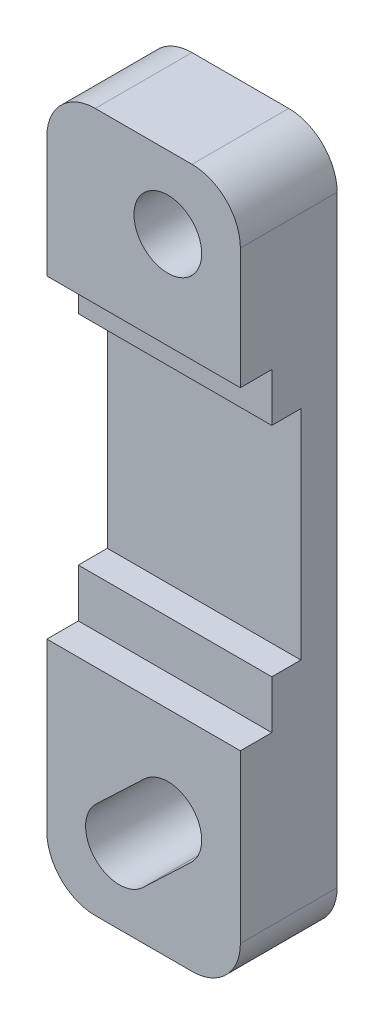
ISO-10303-21;
HEADER;
FILE_DESCRIPTION(('STEP AP214'),'2;1');
FILE_NAME('part.step','',(''),(''),'','','');
FILE_SCHEMA(('AUTOMOTIVE_DESIGN { 1 0 10303 214 1 1 1 1 }'));
ENDSEC;
DATA;
#1=APPLICATION_CONTEXT('core data for automotive mechanical design processes');
#2=APPLICATION_PROTOCOL_DEFINITION('international standard','automotive_design',2000,#1);
#3=PRODUCT_CONTEXT('',#1,'mechanical');
#4=PRODUCT('Part','Part','',(#3));
#5=PRODUCT_RELATED_PRODUCT_CATEGORY('part','',(#4));
#6=PRODUCT_DEFINITION_FORMATION('','',#4);
#7=PRODUCT_DEFINITION_CONTEXT('part definition',#1,'design');
#8=PRODUCT_DEFINITION('design','',#6,#7);
#9=PRODUCT_DEFINITION_SHAPE('','',#8);
#10=(LENGTH_UNIT() NAMED_UNIT(*) SI_UNIT(.MILLI.,.METRE.));
#11=(NAMED_UNIT(*) PLANE_ANGLE_UNIT() SI_UNIT($,.RADIAN.));
#12=(NAMED_UNIT(*) SI_UNIT($,.STERADIAN.) SOLID_ANGLE_UNIT());
#13=UNCERTAINTY_MEASURE_WITH_UNIT(LENGTH_MEASURE(1.E-05),#10,'distance_accuracy_value','');
#14=(GEOMETRIC_REPRESENTATION_CONTEXT(3) GLOBAL_UNCERTAINTY_ASSIGNED_CONTEXT((#13)) GLOBAL_UNIT_ASSIGNED_CONTEXT((#10,
#11,#12)) REPRESENTATION_CONTEXT('',''));
#15=CARTESIAN_POINT('',(0.,0.,0.));
#16=DIRECTION('',(0.,0.,1.));
#17=DIRECTION('',(1.,0.,0.));
#18=AXIS2_PLACEMENT_3D('',#15,#16,#17);
#19=CARTESIAN_POINT('',(1.,11.5,4.));
#20=DIRECTION('',(0.,0.,-1.));
#21=DIRECTION('',(-1.,0.,0.));
#22=AXIS2_PLACEMENT_3D('',#19,#20,#21);
#23=PLANE('',#22);
#24=CARTESIAN_POINT('',(0.,10.5,4.));
#25=DIRECTION('',(0.,0.,1.));
#26=DIRECTION('',(1.,0.,0.));
#27=AXIS2_PLACEMENT_3D('',#24,#25,#26);
#28=CIRCLE('',#27,1.4);
#29=CARTESIAN_POINT('',(1.4,10.5,4.));
#30=VERTEX_POINT('',#29);
#31=EDGE_CURVE('E215',#30,#30,#28,.T.);
#32=ORIENTED_EDGE('',*,*,#31,.F.);
#33=EDGE_LOOP('',(#32));
#34=FACE_BOUND('',#33,.T.);
#35=DIRECTION('',(0.,-1.,0.));
#36=VECTOR('',#35,1.);
#37=CARTESIAN_POINT('',(-5.,11.5,4.));
#38=LINE('',#37,#36);
#39=CARTESIAN_POINT('',(-5.,11.5,4.));
#40=VERTEX_POINT('',#39);
#41=CARTESIAN_POINT('',(-5.,6.5,4.));
#42=VERTEX_POINT('',#41);
#43=EDGE_CURVE('E194',#40,#42,#38,.T.);
#44=ORIENTED_EDGE('',*,*,#43,.T.);
#45=DIRECTION('',(1.,0.,0.));
#46=VECTOR('',#45,1.);
#47=CARTESIAN_POINT('',(-5.,6.5,4.));
#48=LINE('',#47,#46);
#49=CARTESIAN_POINT('',(3.,6.5,4.));
#50=VERTEX_POINT('',#49);
#51=EDGE_CURVE('E299',#42,#50,#48,.T.);
#52=ORIENTED_EDGE('',*,*,#51,.T.);
#53=DIRECTION('',(0.,1.,0.));
#54=VECTOR('',#53,1.);
#55=CARTESIAN_POINT('',(3.,11.5,4.));
#56=LINE('',#55,#54);
#57=CARTESIAN_POINT('',(3.,11.5,4.));
#58=VERTEX_POINT('',#57);
#59=EDGE_CURVE('E208',#50,#58,#56,.T.);
#60=ORIENTED_EDGE('',*,*,#59,.T.);
#61=CARTESIAN_POINT('',(1.,11.5,4.));
#62=DIRECTION('',(0.,0.,1.));
#63=DIRECTION('',(-1.,0.,0.));
#64=AXIS2_PLACEMENT_3D('',#61,#62,#63);
#65=CIRCLE('',#64,2.);
#66=CARTESIAN_POINT('',(0.999999999999987,13.5,4.));
#67=VERTEX_POINT('',#66);
#68=EDGE_CURVE('E229',#58,#67,#65,.T.);
#69=ORIENTED_EDGE('',*,*,#68,.T.);
#70=DIRECTION('',(-1.,0.,0.));
#71=VECTOR('',#70,1.);
#72=CARTESIAN_POINT('',(0.999999999999987,13.5,4.));
#73=LINE('',#72,#71);
#74=CARTESIAN_POINT('',(-2.99999999999999,13.5,4.));
#75=VERTEX_POINT('',#74);
#76=EDGE_CURVE('E199',#67,#75,#73,.T.);
#77=ORIENTED_EDGE('',*,*,#76,.T.);
#78=CARTESIAN_POINT('',(-3.,11.5,4.));
#79=DIRECTION('',(0.,0.,1.));
#80=DIRECTION('',(1.,0.,0.));
#81=AXIS2_PLACEMENT_3D('',#78,#79,#80);
#82=CIRCLE('',#81,2.);
#83=EDGE_CURVE('E195',#75,#40,#82,.T.);
#84=ORIENTED_EDGE('',*,*,#83,.T.);
#85=EDGE_LOOP('',(#44,#52,#60,#69,#77,#84));
#86=FACE_BOUND('',#85,.T.);
#87=ADVANCED_FACE('F33',(#34,#86),#23,.F.);
#88=CARTESIAN_POINT('',(3.,-13.4,4.));
#89=VERTEX_POINT('',#88);
#90=CARTESIAN_POINT('',(3.,-6.5,4.));
#91=VERTEX_POINT('',#90);
#92=EDGE_CURVE('E186',#89,#91,#56,.T.);
#93=ORIENTED_EDGE('',*,*,#92,.T.);
#94=DIRECTION('',(1.,0.,0.));
#95=VECTOR('',#94,1.);
#96=CARTESIAN_POINT('',(-5.,-6.5,4.));
#97=LINE('',#96,#95);
#98=CARTESIAN_POINT('',(-5.,-6.5,4.));
#99=VERTEX_POINT('',#98);
#100=EDGE_CURVE('E48',#99,#91,#97,.T.);
#101=ORIENTED_EDGE('',*,*,#100,.F.);
#102=CARTESIAN_POINT('',(-5.,-13.4,4.));
#103=VERTEX_POINT('',#102);
#104=EDGE_CURVE('E183',#99,#103,#38,.T.);
#105=ORIENTED_EDGE('',*,*,#104,.T.);
#106=CARTESIAN_POINT('',(-3.,-13.4,4.));
#107=DIRECTION('',(0.,0.,1.));
#108=DIRECTION('',(-1.,0.,0.));
#109=AXIS2_PLACEMENT_3D('',#106,#107,#108);
#110=CIRCLE('',#109,2.);
#111=CARTESIAN_POINT('',(-2.99999999999999,-15.4,4.));
#112=VERTEX_POINT('',#111);
#113=EDGE_CURVE('E198',#103,#112,#110,.T.);
#114=ORIENTED_EDGE('',*,*,#113,.T.);
#115=DIRECTION('',(1.,0.,0.));
#116=VECTOR('',#115,1.);
#117=CARTESIAN_POINT('',(0.999999999999984,-15.4,4.));
#118=LINE('',#117,#116);
#119=CARTESIAN_POINT('',(0.999999999999984,-15.4,4.));
#120=VERTEX_POINT('',#119);
#121=EDGE_CURVE('E204',#112,#120,#118,.T.);
#122=ORIENTED_EDGE('',*,*,#121,.T.);
#123=CARTESIAN_POINT('',(0.999999999999998,-13.4,4.));
#124=DIRECTION('',(0.,0.,1.));
#125=DIRECTION('',(-1.,0.,0.));
#126=AXIS2_PLACEMENT_3D('',#123,#124,#125);
#127=CIRCLE('',#126,2.);
#128=EDGE_CURVE('E206',#120,#89,#127,.T.);
#129=ORIENTED_EDGE('',*,*,#128,.T.);
#130=EDGE_LOOP('',(#93,#101,#105,#114,#122,#129));
#131=FACE_BOUND('',#130,.T.);
#132=CARTESIAN_POINT('',(0.,-10.5,4.));
#133=DIRECTION('',(0.,0.,1.));
#134=DIRECTION('',(-1.,0.,0.));
#135=AXIS2_PLACEMENT_3D('',#132,#133,#134);
#136=CIRCLE('',#135,1.4);
#137=CARTESIAN_POINT('',(0.96424924668057,-11.5149992070322,4.));
#138=VERTEX_POINT('',#137);
#139=CARTESIAN_POINT('',(-0.96424924668057,-9.48500079296782,4.));
#140=VERTEX_POINT('',#139);
#141=EDGE_CURVE('E314',#138,#140,#136,.T.);
#142=ORIENTED_EDGE('',*,*,#141,.F.);
#143=DIRECTION('',(0.724999433594414,0.688749461914692,0.));
#144=VECTOR('',#143,1.);
#145=CARTESIAN_POINT('',(0.96424924668057,-11.5149992070322,4.));
#146=LINE('',#145,#144);
#147=CARTESIAN_POINT('',(-1.03575075331943,-13.4149992070322,4.));
#148=VERTEX_POINT('',#147);
#149=EDGE_CURVE('E321',#148,#138,#146,.T.);
#150=ORIENTED_EDGE('',*,*,#149,.F.);
#151=CARTESIAN_POINT('',(-2.,-12.4,4.));
#152=DIRECTION('',(0.,0.,1.));
#153=DIRECTION('',(-1.,0.,0.));
#154=AXIS2_PLACEMENT_3D('',#151,#152,#153);
#155=CIRCLE('',#154,1.4);
#156=CARTESIAN_POINT('',(-2.96424924668057,-11.3850007929678,4.));
#157=VERTEX_POINT('',#156);
#158=EDGE_CURVE('E319',#157,#148,#155,.T.);
#159=ORIENTED_EDGE('',*,*,#158,.F.);
#160=DIRECTION('',(-0.724999433594414,-0.688749461914692,0.));
#161=VECTOR('',#160,1.);
#162=CARTESIAN_POINT('',(-0.96424924668057,-9.48500079296782,4.));
#163=LINE('',#162,#161);
#164=EDGE_CURVE('E316',#140,#157,#163,.T.);
#165=ORIENTED_EDGE('',*,*,#164,.F.);
#166=EDGE_LOOP('',(#142,#150,#159,#165));
#167=FACE_BOUND('',#166,.T.);
#168=ADVANCED_FACE('F181',(#131,#167),#23,.F.);
#169=CARTESIAN_POINT('',(1.,11.5,0.));
#170=DIRECTION('',(0.,0.,-1.));
#171=DIRECTION('',(-1.,0.,0.));
#172=AXIS2_PLACEMENT_3D('',#169,#170,#171);
#173=PLANE('',#172);
#174=CARTESIAN_POINT('',(1.,11.5,0.));
#175=DIRECTION('',(0.,0.,1.));
#176=DIRECTION('',(-1.,0.,0.));
#177=AXIS2_PLACEMENT_3D('',#174,#175,#176);
#178=CIRCLE('',#177,2.);
#179=CARTESIAN_POINT('',(3.,11.5,0.));
#180=VERTEX_POINT('',#179);
#181=CARTESIAN_POINT('',(0.999999999999987,13.5,0.));
#182=VERTEX_POINT('',#181);
#183=EDGE_CURVE('E211',#180,#182,#178,.T.);
#184=ORIENTED_EDGE('',*,*,#183,.F.);
#185=DIRECTION('',(0.,1.,0.));
#186=VECTOR('',#185,1.);
#187=CARTESIAN_POINT('',(3.,11.5,0.));
#188=LINE('',#187,#186);
#189=CARTESIAN_POINT('',(3.,-13.4,0.));
#190=VERTEX_POINT('',#189);
#191=EDGE_CURVE('E227',#190,#180,#188,.T.);
#192=ORIENTED_EDGE('',*,*,#191,.F.);
#193=CARTESIAN_POINT('',(0.999999999999998,-13.4,0.));
#194=DIRECTION('',(0.,0.,1.));
#195=DIRECTION('',(-1.,0.,0.));
#196=AXIS2_PLACEMENT_3D('',#193,#194,#195);
#197=CIRCLE('',#196,2.);
#198=CARTESIAN_POINT('',(0.999999999999984,-15.4,0.));
#199=VERTEX_POINT('',#198);
#200=EDGE_CURVE('E225',#199,#190,#197,.T.);
#201=ORIENTED_EDGE('',*,*,#200,.F.);
#202=DIRECTION('',(1.,0.,0.));
#203=VECTOR('',#202,1.);
#204=CARTESIAN_POINT('',(0.999999999999984,-15.4,0.));
#205=LINE('',#204,#203);
#206=CARTESIAN_POINT('',(-2.99999999999999,-15.4,0.));
#207=VERTEX_POINT('',#206);
#208=EDGE_CURVE('E223',#207,#199,#205,.T.);
#209=ORIENTED_EDGE('',*,*,#208,.F.);
#210=CARTESIAN_POINT('',(-3.,-13.4,0.));
#211=DIRECTION('',(0.,0.,1.));
#212=DIRECTION('',(-1.,0.,0.));
#213=AXIS2_PLACEMENT_3D('',#210,#211,#212);
#214=CIRCLE('',#213,2.);
#215=CARTESIAN_POINT('',(-5.,-13.4,0.));
#216=VERTEX_POINT('',#215);
#217=EDGE_CURVE('E221',#216,#207,#214,.T.);
#218=ORIENTED_EDGE('',*,*,#217,.F.);
#219=DIRECTION('',(0.,-1.,0.));
#220=VECTOR('',#219,1.);
#221=CARTESIAN_POINT('',(-5.,11.5,0.));
#222=LINE('',#221,#220);
#223=CARTESIAN_POINT('',(-5.,11.5,0.));
#224=VERTEX_POINT('',#223);
#225=EDGE_CURVE('E219',#224,#216,#222,.T.);
#226=ORIENTED_EDGE('',*,*,#225,.F.);
#227=CARTESIAN_POINT('',(-3.,11.5,0.));
#228=DIRECTION('',(0.,0.,1.));
#229=DIRECTION('',(1.,0.,0.));
#230=AXIS2_PLACEMENT_3D('',#227,#228,#229);
#231=CIRCLE('',#230,2.);
#232=CARTESIAN_POINT('',(-2.99999999999999,13.5,0.));
#233=VERTEX_POINT('',#232);
#234=EDGE_CURVE('E217',#233,#224,#231,.T.);
#235=ORIENTED_EDGE('',*,*,#234,.F.);
#236=DIRECTION('',(-1.,0.,0.));
#237=VECTOR('',#236,1.);
#238=CARTESIAN_POINT('',(0.999999999999987,13.5,0.));
#239=LINE('',#238,#237);
#240=EDGE_CURVE('E214',#182,#233,#239,.T.);
#241=ORIENTED_EDGE('',*,*,#240,.F.);
#242=EDGE_LOOP('',(#184,#192,#201,#209,#218,#226,#235,#241));
#243=FACE_BOUND('',#242,.T.);
#244=CARTESIAN_POINT('',(0.,10.5,0.));
#245=DIRECTION('',(0.,0.,1.));
#246=DIRECTION('',(1.,0.,0.));
#247=AXIS2_PLACEMENT_3D('',#244,#245,#246);
#248=CIRCLE('',#247,1.4);
#249=CARTESIAN_POINT('',(1.4,10.5,0.));
#250=VERTEX_POINT('',#249);
#251=EDGE_CURVE('E342',#250,#250,#248,.T.);
#252=ORIENTED_EDGE('',*,*,#251,.T.);
#253=EDGE_LOOP('',(#252));
#254=FACE_BOUND('',#253,.T.);
#255=DIRECTION('',(0.724999433594414,0.688749461914692,0.));
#256=VECTOR('',#255,1.);
#257=CARTESIAN_POINT('',(0.96424924668057,-11.5149992070322,0.));
#258=LINE('',#257,#256);
#259=CARTESIAN_POINT('',(-1.03575075331943,-13.4149992070322,0.));
#260=VERTEX_POINT('',#259);
#261=CARTESIAN_POINT('',(0.964249246680569,-11.5149992070322,0.));
#262=VERTEX_POINT('',#261);
#263=EDGE_CURVE('E317',#260,#262,#258,.T.);
#264=ORIENTED_EDGE('',*,*,#263,.T.);
#265=CARTESIAN_POINT('',(0.,-10.5,0.));
#266=DIRECTION('',(0.,0.,1.));
#267=DIRECTION('',(-1.,0.,0.));
#268=AXIS2_PLACEMENT_3D('',#265,#266,#267);
#269=CIRCLE('',#268,1.4);
#270=CARTESIAN_POINT('',(-0.96424924668057,-9.48500079296782,0.));
#271=VERTEX_POINT('',#270);
#272=EDGE_CURVE('E302',#262,#271,#269,.T.);
#273=ORIENTED_EDGE('',*,*,#272,.T.);
#274=DIRECTION('',(-0.724999433594414,-0.688749461914692,0.));
#275=VECTOR('',#274,1.);
#276=CARTESIAN_POINT('',(-0.96424924668057,-9.48500079296782,0.));
#277=LINE('',#276,#275);
#278=CARTESIAN_POINT('',(-2.96424924668057,-11.3850007929678,0.));
#279=VERTEX_POINT('',#278);
#280=EDGE_CURVE('E326',#271,#279,#277,.T.);
#281=ORIENTED_EDGE('',*,*,#280,.T.);
#282=CARTESIAN_POINT('',(-2.,-12.4,0.));
#283=DIRECTION('',(0.,0.,1.));
#284=DIRECTION('',(-1.,0.,0.));
#285=AXIS2_PLACEMENT_3D('',#282,#283,#284);
#286=CIRCLE('',#285,1.4);
#287=EDGE_CURVE('E329',#279,#260,#286,.T.);
#288=ORIENTED_EDGE('',*,*,#287,.T.);
#289=EDGE_LOOP('',(#264,#273,#281,#288));
#290=FACE_BOUND('',#289,.T.);
#291=ADVANCED_FACE('F255',(#243,#254,#290),#173,.T.);
#292=CARTESIAN_POINT('',(1.,11.5,4.));
#293=DIRECTION('',(0.,0.,-1.));
#294=DIRECTION('',(-1.,0.,0.));
#295=AXIS2_PLACEMENT_3D('',#292,#293,#294);
#296=CYLINDRICAL_SURFACE('',#295,2.);
#297=ORIENTED_EDGE('',*,*,#183,.T.);
#298=DIRECTION('',(0.,0.,-1.));
#299=VECTOR('',#298,1.);
#300=CARTESIAN_POINT('',(0.999999999999987,13.5,4.));
#301=LINE('',#300,#299);
#302=EDGE_CURVE('E11',#67,#182,#301,.T.);
#303=ORIENTED_EDGE('',*,*,#302,.F.);
#304=ORIENTED_EDGE('',*,*,#68,.F.);
#305=DIRECTION('',(0.,0.,-1.));
#306=VECTOR('',#305,1.);
#307=CARTESIAN_POINT('',(3.,11.5,4.));
#308=LINE('',#307,#306);
#309=EDGE_CURVE('E210',#58,#180,#308,.T.);
#310=ORIENTED_EDGE('',*,*,#309,.T.);
#311=EDGE_LOOP('',(#297,#303,#304,#310));
#312=FACE_BOUND('',#311,.T.);
#313=ADVANCED_FACE('F35',(#312),#296,.T.);
#314=CARTESIAN_POINT('',(0.999999999999987,13.5,4.));
#315=DIRECTION('',(0.,-1.,0.));
#316=DIRECTION('',(0.,0.,-1.));
#317=AXIS2_PLACEMENT_3D('',#314,#315,#316);
#318=PLANE('',#317);
#319=ORIENTED_EDGE('',*,*,#240,.T.);
#320=DIRECTION('',(0.,0.,-1.));
#321=VECTOR('',#320,1.);
#322=CARTESIAN_POINT('',(-2.99999999999999,13.5,4.));
#323=LINE('',#322,#321);
#324=EDGE_CURVE('E41',#75,#233,#323,.T.);
#325=ORIENTED_EDGE('',*,*,#324,.F.);
#326=ORIENTED_EDGE('',*,*,#76,.F.);
#327=ORIENTED_EDGE('',*,*,#302,.T.);
#328=EDGE_LOOP('',(#319,#325,#326,#327));
#329=FACE_BOUND('',#328,.T.);
#330=ADVANCED_FACE('F351',(#329),#318,.F.);
#331=CARTESIAN_POINT('',(-3.,11.5,4.));
#332=DIRECTION('',(0.,0.,-1.));
#333=DIRECTION('',(-1.,0.,0.));
#334=AXIS2_PLACEMENT_3D('',#331,#332,#333);
#335=CYLINDRICAL_SURFACE('',#334,2.);
#336=ORIENTED_EDGE('',*,*,#234,.T.);
#337=DIRECTION('',(0.,0.,-1.));
#338=VECTOR('',#337,1.);
#339=CARTESIAN_POINT('',(-5.,11.5,4.));
#340=LINE('',#339,#338);
#341=EDGE_CURVE('E242',#40,#224,#340,.T.);
#342=ORIENTED_EDGE('',*,*,#341,.F.);
#343=ORIENTED_EDGE('',*,*,#83,.F.);
#344=ORIENTED_EDGE('',*,*,#324,.T.);
#345=EDGE_LOOP('',(#336,#342,#343,#344));
#346=FACE_BOUND('',#345,.T.);
#347=ADVANCED_FACE('F249',(#346),#335,.T.);
#348=CARTESIAN_POINT('',(-5.,11.5,4.));
#349=DIRECTION('',(1.,0.,0.));
#350=DIRECTION('',(0.,1.,0.));
#351=AXIS2_PLACEMENT_3D('',#348,#349,#350);
#352=PLANE('',#351);
#353=DIRECTION('',(0.,1.,0.));
#354=VECTOR('',#353,1.);
#355=CARTESIAN_POINT('',(-5.,6.5,2.7));
#356=LINE('',#355,#354);
#357=CARTESIAN_POINT('',(-5.,4.5,2.7));
#358=VERTEX_POINT('',#357);
#359=CARTESIAN_POINT('',(-5.,6.5,2.7));
#360=VERTEX_POINT('',#359);
#361=EDGE_CURVE('E362',#358,#360,#356,.T.);
#362=ORIENTED_EDGE('',*,*,#361,.T.);
#363=DIRECTION('',(0.,0.,1.));
#364=VECTOR('',#363,1.);
#365=CARTESIAN_POINT('',(-5.,6.5,4.));
#366=LINE('',#365,#364);
#367=EDGE_CURVE('E187',#360,#42,#366,.T.);
#368=ORIENTED_EDGE('',*,*,#367,.T.);
#369=ORIENTED_EDGE('',*,*,#43,.F.);
#370=ORIENTED_EDGE('',*,*,#341,.T.);
#371=ORIENTED_EDGE('',*,*,#225,.T.);
#372=DIRECTION('',(0.,0.,-1.));
#373=VECTOR('',#372,1.);
#374=CARTESIAN_POINT('',(-5.,-13.4,4.));
#375=LINE('',#374,#373);
#376=EDGE_CURVE('E192',#103,#216,#375,.T.);
#377=ORIENTED_EDGE('',*,*,#376,.F.);
#378=ORIENTED_EDGE('',*,*,#104,.F.);
#379=DIRECTION('',(0.,0.,-1.));
#380=VECTOR('',#379,1.);
#381=CARTESIAN_POINT('',(-5.,-6.5,4.));
#382=LINE('',#381,#380);
#383=CARTESIAN_POINT('',(-5.,-6.5,2.7));
#384=VERTEX_POINT('',#383);
#385=EDGE_CURVE('E169',#99,#384,#382,.T.);
#386=ORIENTED_EDGE('',*,*,#385,.T.);
#387=DIRECTION('',(0.,1.,0.));
#388=VECTOR('',#387,1.);
#389=CARTESIAN_POINT('',(-5.,-4.5,2.7));
#390=LINE('',#389,#388);
#391=CARTESIAN_POINT('',(-5.,-4.5,2.7));
#392=VERTEX_POINT('',#391);
#393=EDGE_CURVE('E176',#384,#392,#390,.T.);
#394=ORIENTED_EDGE('',*,*,#393,.T.);
#395=DIRECTION('',(0.,0.,-1.));
#396=VECTOR('',#395,1.);
#397=CARTESIAN_POINT('',(-5.,-4.5,1.5));
#398=LINE('',#397,#396);
#399=CARTESIAN_POINT('',(-5.,-4.5,1.5));
#400=VERTEX_POINT('',#399);
#401=EDGE_CURVE('E369',#392,#400,#398,.T.);
#402=ORIENTED_EDGE('',*,*,#401,.T.);
#403=DIRECTION('',(0.,1.,0.));
#404=VECTOR('',#403,1.);
#405=CARTESIAN_POINT('',(-5.,4.5,1.5));
#406=LINE('',#405,#404);
#407=CARTESIAN_POINT('',(-5.,4.5,1.5));
#408=VERTEX_POINT('',#407);
#409=EDGE_CURVE('E364',#400,#408,#406,.T.);
#410=ORIENTED_EDGE('',*,*,#409,.T.);
#411=DIRECTION('',(0.,0.,1.));
#412=VECTOR('',#411,1.);
#413=CARTESIAN_POINT('',(-5.,4.5,2.7));
#414=LINE('',#413,#412);
#415=EDGE_CURVE('E363',#408,#358,#414,.T.);
#416=ORIENTED_EDGE('',*,*,#415,.T.);
#417=EDGE_LOOP('',(#362,#368,#369,#370,#371,#377,#378,#386,#394,#402,#410,#416));
#418=FACE_BOUND('',#417,.T.);
#419=ADVANCED_FACE('F190',(#418),#352,.F.);
#420=CARTESIAN_POINT('',(-3.,-13.4,4.));
#421=DIRECTION('',(0.,0.,-1.));
#422=DIRECTION('',(-1.,0.,0.));
#423=AXIS2_PLACEMENT_3D('',#420,#421,#422);
#424=CYLINDRICAL_SURFACE('',#423,2.);
#425=ORIENTED_EDGE('',*,*,#217,.T.);
#426=DIRECTION('',(0.,0.,-1.));
#427=VECTOR('',#426,1.);
#428=CARTESIAN_POINT('',(-2.99999999999999,-15.4,4.));
#429=LINE('',#428,#427);
#430=EDGE_CURVE('E238',#112,#207,#429,.T.);
#431=ORIENTED_EDGE('',*,*,#430,.F.);
#432=ORIENTED_EDGE('',*,*,#113,.F.);
#433=ORIENTED_EDGE('',*,*,#376,.T.);
#434=EDGE_LOOP('',(#425,#431,#432,#433));
#435=FACE_BOUND('',#434,.T.);
#436=ADVANCED_FACE('F261',(#435),#424,.T.);
#437=CARTESIAN_POINT('',(0.999999999999984,-15.4,4.));
#438=DIRECTION('',(0.,1.,0.));
#439=DIRECTION('',(0.,0.,1.));
#440=AXIS2_PLACEMENT_3D('',#437,#438,#439);
#441=PLANE('',#440);
#442=ORIENTED_EDGE('',*,*,#208,.T.);
#443=DIRECTION('',(0.,0.,-1.));
#444=VECTOR('',#443,1.);
#445=CARTESIAN_POINT('',(0.999999999999984,-15.4,4.));
#446=LINE('',#445,#444);
#447=EDGE_CURVE('E235',#120,#199,#446,.T.);
#448=ORIENTED_EDGE('',*,*,#447,.F.);
#449=ORIENTED_EDGE('',*,*,#121,.F.);
#450=ORIENTED_EDGE('',*,*,#430,.T.);
#451=EDGE_LOOP('',(#442,#448,#449,#450));
#452=FACE_BOUND('',#451,.T.);
#453=ADVANCED_FACE('F268',(#452),#441,.F.);
#454=CARTESIAN_POINT('',(0.999999999999998,-13.4,4.));
#455=DIRECTION('',(0.,0.,-1.));
#456=DIRECTION('',(-1.,0.,0.));
#457=AXIS2_PLACEMENT_3D('',#454,#455,#456);
#458=CYLINDRICAL_SURFACE('',#457,2.);
#459=ORIENTED_EDGE('',*,*,#200,.T.);
#460=DIRECTION('',(0.,0.,-1.));
#461=VECTOR('',#460,1.);
#462=CARTESIAN_POINT('',(3.,-13.4,4.));
#463=LINE('',#462,#461);
#464=EDGE_CURVE('E232',#89,#190,#463,.T.);
#465=ORIENTED_EDGE('',*,*,#464,.F.);
#466=ORIENTED_EDGE('',*,*,#128,.F.);
#467=ORIENTED_EDGE('',*,*,#447,.T.);
#468=EDGE_LOOP('',(#459,#465,#466,#467));
#469=FACE_BOUND('',#468,.T.);
#470=ADVANCED_FACE('F271',(#469),#458,.T.);
#471=CARTESIAN_POINT('',(3.,11.5,4.));
#472=DIRECTION('',(-1.,0.,0.));
#473=DIRECTION('',(0.,-1.,0.));
#474=AXIS2_PLACEMENT_3D('',#471,#472,#473);
#475=PLANE('',#474);
#476=ORIENTED_EDGE('',*,*,#59,.F.);
#477=DIRECTION('',(0.,0.,1.));
#478=VECTOR('',#477,1.);
#479=CARTESIAN_POINT('',(3.,6.5,4.));
#480=LINE('',#479,#478);
#481=CARTESIAN_POINT('',(3.,6.5,2.7));
#482=VERTEX_POINT('',#481);
#483=EDGE_CURVE('E177',#482,#50,#480,.T.);
#484=ORIENTED_EDGE('',*,*,#483,.F.);
#485=DIRECTION('',(0.,1.,0.));
#486=VECTOR('',#485,1.);
#487=CARTESIAN_POINT('',(3.,6.5,2.7));
#488=LINE('',#487,#486);
#489=CARTESIAN_POINT('',(3.,4.5,2.7));
#490=VERTEX_POINT('',#489);
#491=EDGE_CURVE('E295',#490,#482,#488,.T.);
#492=ORIENTED_EDGE('',*,*,#491,.F.);
#493=DIRECTION('',(0.,0.,1.));
#494=VECTOR('',#493,1.);
#495=CARTESIAN_POINT('',(3.,4.5,2.7));
#496=LINE('',#495,#494);
#497=CARTESIAN_POINT('',(3.,4.5,1.5));
#498=VERTEX_POINT('',#497);
#499=EDGE_CURVE('E292',#498,#490,#496,.T.);
#500=ORIENTED_EDGE('',*,*,#499,.F.);
#501=DIRECTION('',(0.,1.,0.));
#502=VECTOR('',#501,1.);
#503=CARTESIAN_POINT('',(3.,4.5,1.5));
#504=LINE('',#503,#502);
#505=CARTESIAN_POINT('',(3.,-4.5,1.5));
#506=VERTEX_POINT('',#505);
#507=EDGE_CURVE('E289',#506,#498,#504,.T.);
#508=ORIENTED_EDGE('',*,*,#507,.F.);
#509=DIRECTION('',(0.,0.,-1.));
#510=VECTOR('',#509,1.);
#511=CARTESIAN_POINT('',(3.,-4.5,1.5));
#512=LINE('',#511,#510);
#513=CARTESIAN_POINT('',(3.,-4.5,2.7));
#514=VERTEX_POINT('',#513);
#515=EDGE_CURVE('E282',#514,#506,#512,.T.);
#516=ORIENTED_EDGE('',*,*,#515,.F.);
#517=DIRECTION('',(0.,1.,0.));
#518=VECTOR('',#517,1.);
#519=CARTESIAN_POINT('',(3.,-4.5,2.7));
#520=LINE('',#519,#518);
#521=CARTESIAN_POINT('',(3.,-6.5,2.7));
#522=VERTEX_POINT('',#521);
#523=EDGE_CURVE('E280',#522,#514,#520,.T.);
#524=ORIENTED_EDGE('',*,*,#523,.F.);
#525=DIRECTION('',(0.,0.,-1.));
#526=VECTOR('',#525,1.);
#527=CARTESIAN_POINT('',(3.,-6.5,4.));
#528=LINE('',#527,#526);
#529=EDGE_CURVE('E277',#91,#522,#528,.T.);
#530=ORIENTED_EDGE('',*,*,#529,.F.);
#531=ORIENTED_EDGE('',*,*,#92,.F.);
#532=ORIENTED_EDGE('',*,*,#464,.T.);
#533=ORIENTED_EDGE('',*,*,#191,.T.);
#534=ORIENTED_EDGE('',*,*,#309,.F.);
#535=EDGE_LOOP('',(#476,#484,#492,#500,#508,#516,#524,#530,#531,#532,#533,#534));
#536=FACE_BOUND('',#535,.T.);
#537=ADVANCED_FACE('F275',(#536),#475,.F.);
#538=CARTESIAN_POINT('',(0.,10.5,4.));
#539=DIRECTION('',(0.,0.,-1.));
#540=DIRECTION('',(-1.,0.,0.));
#541=AXIS2_PLACEMENT_3D('',#538,#539,#540);
#542=CYLINDRICAL_SURFACE('',#541,1.4);
#543=ORIENTED_EDGE('',*,*,#31,.T.);
#544=EDGE_LOOP('',(#543));
#545=FACE_BOUND('',#544,.T.);
#546=ORIENTED_EDGE('',*,*,#251,.F.);
#547=EDGE_LOOP('',(#546));
#548=FACE_BOUND('',#547,.T.);
#549=ADVANCED_FACE('F405',(#545,#548),#542,.F.);
#550=CARTESIAN_POINT('',(0.,-10.5,4.));
#551=DIRECTION('',(0.,0.,-1.));
#552=DIRECTION('',(-1.,0.,0.));
#553=AXIS2_PLACEMENT_3D('',#550,#551,#552);
#554=CYLINDRICAL_SURFACE('',#553,1.4);
#555=ORIENTED_EDGE('',*,*,#272,.F.);
#556=DIRECTION('',(0.,0.,-1.));
#557=VECTOR('',#556,1.);
#558=CARTESIAN_POINT('',(0.96424924668057,-11.5149992070322,4.));
#559=LINE('',#558,#557);
#560=EDGE_CURVE('E323',#138,#262,#559,.T.);
#561=ORIENTED_EDGE('',*,*,#560,.F.);
#562=ORIENTED_EDGE('',*,*,#141,.T.);
#563=DIRECTION('',(0.,0.,-1.));
#564=VECTOR('',#563,1.);
#565=CARTESIAN_POINT('',(-0.96424924668057,-9.48500079296782,4.));
#566=LINE('',#565,#564);
#567=EDGE_CURVE('E339',#140,#271,#566,.T.);
#568=ORIENTED_EDGE('',*,*,#567,.T.);
#569=EDGE_LOOP('',(#555,#561,#562,#568));
#570=FACE_BOUND('',#569,.T.);
#571=ADVANCED_FACE('F515',(#570),#554,.F.);
#572=CARTESIAN_POINT('',(-0.96424924668057,-9.48500079296782,4.));
#573=DIRECTION('',(0.688749461914693,-0.724999433594414,0.));
#574=DIRECTION('',(0.724999433594414,0.688749461914693,0.));
#575=AXIS2_PLACEMENT_3D('',#572,#573,#574);
#576=PLANE('',#575);
#577=ORIENTED_EDGE('',*,*,#280,.F.);
#578=ORIENTED_EDGE('',*,*,#567,.F.);
#579=ORIENTED_EDGE('',*,*,#164,.T.);
#580=DIRECTION('',(0.,0.,-1.));
#581=VECTOR('',#580,1.);
#582=CARTESIAN_POINT('',(-2.96424924668057,-11.3850007929678,4.));
#583=LINE('',#582,#581);
#584=EDGE_CURVE('E337',#157,#279,#583,.T.);
#585=ORIENTED_EDGE('',*,*,#584,.T.);
#586=EDGE_LOOP('',(#577,#578,#579,#585));
#587=FACE_BOUND('',#586,.T.);
#588=ADVANCED_FACE('F512',(#587),#576,.T.);
#589=CARTESIAN_POINT('',(-2.,-12.4,4.));
#590=DIRECTION('',(0.,0.,-1.));
#591=DIRECTION('',(-1.,0.,0.));
#592=AXIS2_PLACEMENT_3D('',#589,#590,#591);
#593=CYLINDRICAL_SURFACE('',#592,1.4);
#594=ORIENTED_EDGE('',*,*,#287,.F.);
#595=ORIENTED_EDGE('',*,*,#584,.F.);
#596=ORIENTED_EDGE('',*,*,#158,.T.);
#597=DIRECTION('',(0.,0.,-1.));
#598=VECTOR('',#597,1.);
#599=CARTESIAN_POINT('',(-1.03575075331943,-13.4149992070322,4.));
#600=LINE('',#599,#598);
#601=EDGE_CURVE('E56',#148,#260,#600,.T.);
#602=ORIENTED_EDGE('',*,*,#601,.T.);
#603=EDGE_LOOP('',(#594,#595,#596,#602));
#604=FACE_BOUND('',#603,.T.);
#605=ADVANCED_FACE('F509',(#604),#593,.F.);
#606=CARTESIAN_POINT('',(0.96424924668057,-11.5149992070322,4.));
#607=DIRECTION('',(-0.688749461914692,0.724999433594414,0.));
#608=DIRECTION('',(-0.724999433594415,-0.688749461914692,0.));
#609=AXIS2_PLACEMENT_3D('',#606,#607,#608);
#610=PLANE('',#609);
#611=ORIENTED_EDGE('',*,*,#263,.F.);
#612=ORIENTED_EDGE('',*,*,#601,.F.);
#613=ORIENTED_EDGE('',*,*,#149,.T.);
#614=ORIENTED_EDGE('',*,*,#560,.T.);
#615=EDGE_LOOP('',(#611,#612,#613,#614));
#616=FACE_BOUND('',#615,.T.);
#617=ADVANCED_FACE('F394',(#616),#610,.T.);
#618=CARTESIAN_POINT('',(-5.,6.5,4.));
#619=DIRECTION('',(0.,1.,0.));
#620=DIRECTION('',(0.,0.,1.));
#621=AXIS2_PLACEMENT_3D('',#618,#619,#620);
#622=PLANE('',#621);
#623=ORIENTED_EDGE('',*,*,#483,.T.);
#624=ORIENTED_EDGE('',*,*,#51,.F.);
#625=ORIENTED_EDGE('',*,*,#367,.F.);
#626=DIRECTION('',(1.,0.,0.));
#627=VECTOR('',#626,1.);
#628=CARTESIAN_POINT('',(-5.,6.5,2.7));
#629=LINE('',#628,#627);
#630=EDGE_CURVE('E303',#360,#482,#629,.T.);
#631=ORIENTED_EDGE('',*,*,#630,.T.);
#632=EDGE_LOOP('',(#623,#624,#625,#631));
#633=FACE_BOUND('',#632,.T.);
#634=ADVANCED_FACE('F359',(#633),#622,.F.);
#635=CARTESIAN_POINT('',(-5.,6.5,2.7));
#636=DIRECTION('',(0.,0.,-1.));
#637=DIRECTION('',(0.,1.,0.));
#638=AXIS2_PLACEMENT_3D('',#635,#636,#637);
#639=PLANE('',#638);
#640=ORIENTED_EDGE('',*,*,#491,.T.);
#641=ORIENTED_EDGE('',*,*,#630,.F.);
#642=ORIENTED_EDGE('',*,*,#361,.F.);
#643=DIRECTION('',(1.,0.,0.));
#644=VECTOR('',#643,1.);
#645=CARTESIAN_POINT('',(-5.,4.5,2.7));
#646=LINE('',#645,#644);
#647=EDGE_CURVE('E305',#358,#490,#646,.T.);
#648=ORIENTED_EDGE('',*,*,#647,.T.);
#649=EDGE_LOOP('',(#640,#641,#642,#648));
#650=FACE_BOUND('',#649,.T.);
#651=ADVANCED_FACE('F386',(#650),#639,.F.);
#652=CARTESIAN_POINT('',(-5.,4.5,2.7));
#653=DIRECTION('',(0.,1.,0.));
#654=DIRECTION('',(0.,0.,1.));
#655=AXIS2_PLACEMENT_3D('',#652,#653,#654);
#656=PLANE('',#655);
#657=ORIENTED_EDGE('',*,*,#499,.T.);
#658=ORIENTED_EDGE('',*,*,#647,.F.);
#659=ORIENTED_EDGE('',*,*,#415,.F.);
#660=DIRECTION('',(1.,0.,0.));
#661=VECTOR('',#660,1.);
#662=CARTESIAN_POINT('',(-5.,4.5,1.5));
#663=LINE('',#662,#661);
#664=EDGE_CURVE('E307',#408,#498,#663,.T.);
#665=ORIENTED_EDGE('',*,*,#664,.T.);
#666=EDGE_LOOP('',(#657,#658,#659,#665));
#667=FACE_BOUND('',#666,.T.);
#668=ADVANCED_FACE('F383',(#667),#656,.F.);
#669=CARTESIAN_POINT('',(-5.,4.5,1.5));
#670=DIRECTION('',(0.,0.,-1.));
#671=DIRECTION('',(-1.,0.,0.));
#672=AXIS2_PLACEMENT_3D('',#669,#670,#671);
#673=PLANE('',#672);
#674=ORIENTED_EDGE('',*,*,#507,.T.);
#675=ORIENTED_EDGE('',*,*,#664,.F.);
#676=ORIENTED_EDGE('',*,*,#409,.F.);
#677=DIRECTION('',(1.,0.,0.));
#678=VECTOR('',#677,1.);
#679=CARTESIAN_POINT('',(-5.,-4.5,1.5));
#680=LINE('',#679,#678);
#681=EDGE_CURVE('E309',#400,#506,#680,.T.);
#682=ORIENTED_EDGE('',*,*,#681,.T.);
#683=EDGE_LOOP('',(#674,#675,#676,#682));
#684=FACE_BOUND('',#683,.T.);
#685=ADVANCED_FACE('F380',(#684),#673,.F.);
#686=CARTESIAN_POINT('',(-5.,-4.5,1.5));
#687=DIRECTION('',(0.,-1.,0.));
#688=DIRECTION('',(0.,0.,-1.));
#689=AXIS2_PLACEMENT_3D('',#686,#687,#688);
#690=PLANE('',#689);
#691=ORIENTED_EDGE('',*,*,#515,.T.);
#692=ORIENTED_EDGE('',*,*,#681,.F.);
#693=ORIENTED_EDGE('',*,*,#401,.F.);
#694=DIRECTION('',(1.,0.,0.));
#695=VECTOR('',#694,1.);
#696=CARTESIAN_POINT('',(-5.,-4.5,2.7));
#697=LINE('',#696,#695);
#698=EDGE_CURVE('E311',#392,#514,#697,.T.);
#699=ORIENTED_EDGE('',*,*,#698,.T.);
#700=EDGE_LOOP('',(#691,#692,#693,#699));
#701=FACE_BOUND('',#700,.T.);
#702=ADVANCED_FACE('F376',(#701),#690,.F.);
#703=CARTESIAN_POINT('',(-5.,-4.5,2.7));
#704=DIRECTION('',(0.,0.,-1.));
#705=DIRECTION('',(0.,1.,0.));
#706=AXIS2_PLACEMENT_3D('',#703,#704,#705);
#707=PLANE('',#706);
#708=ORIENTED_EDGE('',*,*,#523,.T.);
#709=ORIENTED_EDGE('',*,*,#698,.F.);
#710=ORIENTED_EDGE('',*,*,#393,.F.);
#711=DIRECTION('',(1.,0.,0.));
#712=VECTOR('',#711,1.);
#713=CARTESIAN_POINT('',(-5.,-6.5,2.7));
#714=LINE('',#713,#712);
#715=EDGE_CURVE('E171',#384,#522,#714,.T.);
#716=ORIENTED_EDGE('',*,*,#715,.T.);
#717=EDGE_LOOP('',(#708,#709,#710,#716));
#718=FACE_BOUND('',#717,.T.);
#719=ADVANCED_FACE('F374',(#718),#707,.F.);
#720=CARTESIAN_POINT('',(-5.,-6.5,4.));
#721=DIRECTION('',(0.,-1.,0.));
#722=DIRECTION('',(0.,0.,-1.));
#723=AXIS2_PLACEMENT_3D('',#720,#721,#722);
#724=PLANE('',#723);
#725=ORIENTED_EDGE('',*,*,#529,.T.);
#726=ORIENTED_EDGE('',*,*,#715,.F.);
#727=ORIENTED_EDGE('',*,*,#385,.F.);
#728=ORIENTED_EDGE('',*,*,#100,.T.);
#729=EDGE_LOOP('',(#725,#726,#727,#728));
#730=FACE_BOUND('',#729,.T.);
#731=ADVANCED_FACE('F170',(#730),#724,.F.);
#732=CLOSED_SHELL('',(#87,#168,#291,#313,#330,#347,#419,#436,#453,#470,#537,#549,#571,#588,#605,
#617,#634,#651,#668,#685,#702,#719,#731));
#733=MANIFOLD_SOLID_BREP('B2',#732);
#734=ADVANCED_BREP_SHAPE_REPRESENTATION('',(#18,#733),#14);
#735=SHAPE_DEFINITION_REPRESENTATION(#9,#734);
ENDSEC;
END-ISO-10303-21;
